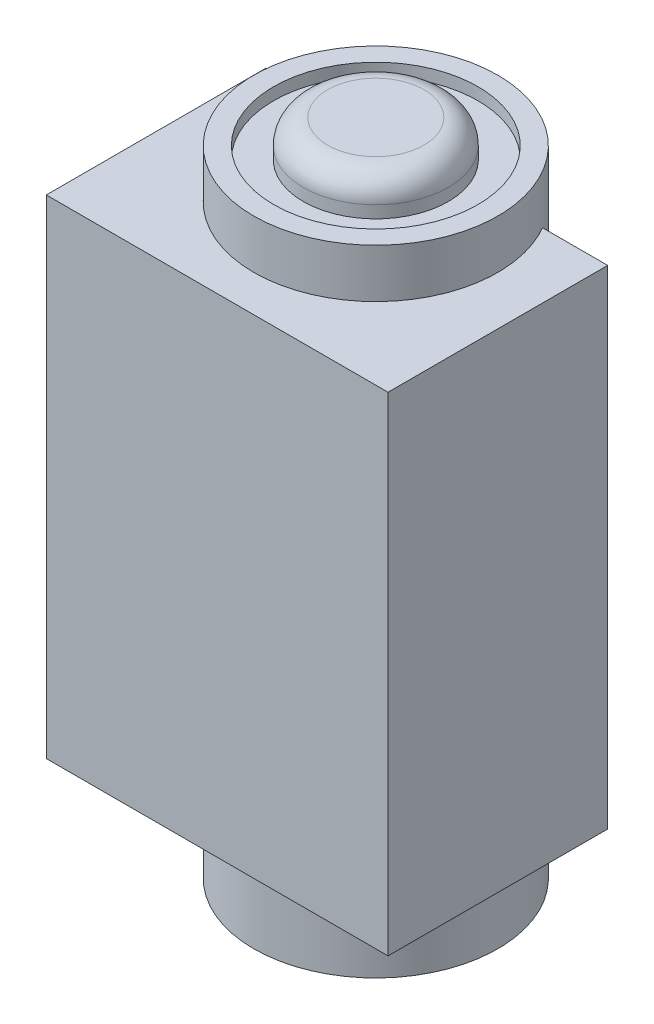
ISO-10303-21;
HEADER;
FILE_DESCRIPTION(('STEP AP214'),'2;1');
FILE_NAME('part.step','',(''),(''),'','','');
FILE_SCHEMA(('AUTOMOTIVE_DESIGN { 1 0 10303 214 1 1 1 1 }'));
ENDSEC;
DATA;
#1=APPLICATION_CONTEXT('core data for automotive mechanical design processes');
#2=APPLICATION_PROTOCOL_DEFINITION('international standard','automotive_design',2000,#1);
#3=PRODUCT_CONTEXT('',#1,'mechanical');
#4=PRODUCT('Part','Part','',(#3));
#5=PRODUCT_RELATED_PRODUCT_CATEGORY('part','',(#4));
#6=PRODUCT_DEFINITION_FORMATION('','',#4);
#7=PRODUCT_DEFINITION_CONTEXT('part definition',#1,'design');
#8=PRODUCT_DEFINITION('design','',#6,#7);
#9=PRODUCT_DEFINITION_SHAPE('','',#8);
#10=(LENGTH_UNIT() NAMED_UNIT(*) SI_UNIT(.MILLI.,.METRE.));
#11=(NAMED_UNIT(*) PLANE_ANGLE_UNIT() SI_UNIT($,.RADIAN.));
#12=(NAMED_UNIT(*) SI_UNIT($,.STERADIAN.) SOLID_ANGLE_UNIT());
#13=UNCERTAINTY_MEASURE_WITH_UNIT(LENGTH_MEASURE(1.E-05),#10,'distance_accuracy_value','');
#14=(GEOMETRIC_REPRESENTATION_CONTEXT(3) GLOBAL_UNCERTAINTY_ASSIGNED_CONTEXT((#13)) GLOBAL_UNIT_ASSIGNED_CONTEXT((#10,
#11,#12)) REPRESENTATION_CONTEXT('',''));
#15=CARTESIAN_POINT('',(0.,0.,0.));
#16=DIRECTION('',(0.,0.,1.));
#17=DIRECTION('',(1.,0.,0.));
#18=AXIS2_PLACEMENT_3D('',#15,#16,#17);
#19=CARTESIAN_POINT('',(0.,-4.,-2.));
#20=DIRECTION('',(0.,1.,0.));
#21=DIRECTION('',(0.,0.,1.));
#22=AXIS2_PLACEMENT_3D('',#19,#20,#21);
#23=CYLINDRICAL_SURFACE('',#22,4.19121199562566);
#24=CARTESIAN_POINT('',(0.,-4.,-2.));
#25=DIRECTION('',(0.,-1.,0.));
#26=DIRECTION('',(0.,0.,-1.));
#27=AXIS2_PLACEMENT_3D('',#24,#25,#26);
#28=CIRCLE('',#27,4.19121199562566);
#29=CARTESIAN_POINT('',(0.,-4.,-6.19121199562566));
#30=VERTEX_POINT('',#29);
#31=EDGE_CURVE('E11',#30,#30,#28,.T.);
#32=ORIENTED_EDGE('',*,*,#31,.F.);
#33=EDGE_LOOP('',(#32));
#34=FACE_BOUND('',#33,.T.);
#35=CARTESIAN_POINT('',(0.,-3.75,-2.));
#36=DIRECTION('',(0.,-1.,0.));
#37=DIRECTION('',(0.,0.,-1.));
#38=AXIS2_PLACEMENT_3D('',#35,#36,#37);
#39=CIRCLE('',#38,4.19121199562566);
#40=CARTESIAN_POINT('',(0.,-3.75,-6.19121199562566));
#41=VERTEX_POINT('',#40);
#42=EDGE_CURVE('E51',#41,#41,#39,.T.);
#43=ORIENTED_EDGE('',*,*,#42,.T.);
#44=EDGE_LOOP('',(#43));
#45=FACE_BOUND('',#44,.T.);
#46=ADVANCED_FACE('F48',(#34,#45),#23,.T.);
#47=CARTESIAN_POINT('',(0.,-4.,-2.));
#48=DIRECTION('',(0.,-1.,0.));
#49=DIRECTION('',(0.,0.,-1.));
#50=AXIS2_PLACEMENT_3D('',#47,#48,#49);
#51=PLANE('',#50);
#52=ORIENTED_EDGE('',*,*,#31,.T.);
#53=EDGE_LOOP('',(#52));
#54=FACE_BOUND('',#53,.T.);
#55=ADVANCED_FACE('F63',(#54),#51,.T.);
#56=CARTESIAN_POINT('',(0.,-3.75,-2.));
#57=DIRECTION('',(0.,-1.,0.));
#58=DIRECTION('',(0.,0.,-1.));
#59=AXIS2_PLACEMENT_3D('',#56,#57,#58);
#60=PLANE('',#59);
#61=ORIENTED_EDGE('',*,*,#42,.F.);
#62=EDGE_LOOP('',(#61));
#63=FACE_BOUND('',#62,.T.);
#64=ADVANCED_FACE('F61',(#63),#60,.F.);
#65=CLOSED_SHELL('',(#46,#55,#64));
#66=MANIFOLD_SOLID_BREP('B2',#65);
#67=CARTESIAN_POINT('',(0.,22.,-2.));
#68=DIRECTION('',(0.,-1.,0.));
#69=DIRECTION('',(0.,0.,-1.));
#70=AXIS2_PLACEMENT_3D('',#67,#68,#69);
#71=CYLINDRICAL_SURFACE('',#70,5.);
#72=CARTESIAN_POINT('',(0.,22.,-2.));
#73=DIRECTION('',(0.,1.,0.));
#74=DIRECTION('',(0.,0.,1.));
#75=AXIS2_PLACEMENT_3D('',#72,#73,#74);
#76=CIRCLE('',#75,5.);
#77=CARTESIAN_POINT('',(0.,22.,3.00000000000001));
#78=VERTEX_POINT('',#77);
#79=EDGE_CURVE('E111',#78,#78,#76,.T.);
#80=ORIENTED_EDGE('',*,*,#79,.F.);
#81=EDGE_LOOP('',(#80));
#82=FACE_BOUND('',#81,.T.);
#83=CARTESIAN_POINT('',(0.,-4.,-2.));
#84=DIRECTION('',(0.,1.,0.));
#85=DIRECTION('',(0.,0.,1.));
#86=AXIS2_PLACEMENT_3D('',#83,#84,#85);
#87=CIRCLE('',#86,5.);
#88=CARTESIAN_POINT('',(0.,-4.,3.00000000000001));
#89=VERTEX_POINT('',#88);
#90=EDGE_CURVE('E116',#89,#89,#87,.T.);
#91=ORIENTED_EDGE('',*,*,#90,.T.);
#92=EDGE_LOOP('',(#91));
#93=FACE_BOUND('',#92,.T.);
#94=ADVANCED_FACE('F98',(#82,#93),#71,.T.);
#95=CARTESIAN_POINT('',(0.,22.,-2.));
#96=DIRECTION('',(0.,1.,0.));
#97=DIRECTION('',(0.,0.,1.));
#98=AXIS2_PLACEMENT_3D('',#95,#96,#97);
#99=PLANE('',#98);
#100=CARTESIAN_POINT('',(0.,22.,-2.));
#101=DIRECTION('',(0.,1.,0.));
#102=DIRECTION('',(0.,0.,1.));
#103=AXIS2_PLACEMENT_3D('',#100,#101,#102);
#104=CIRCLE('',#103,4.18633493687747);
#105=CARTESIAN_POINT('',(0.,22.,2.18633493687747));
#106=VERTEX_POINT('',#105);
#107=EDGE_CURVE('E123',#106,#106,#104,.T.);
#108=ORIENTED_EDGE('',*,*,#107,.F.);
#109=EDGE_LOOP('',(#108));
#110=FACE_BOUND('',#109,.T.);
#111=ORIENTED_EDGE('',*,*,#79,.T.);
#112=EDGE_LOOP('',(#111));
#113=FACE_BOUND('',#112,.T.);
#114=ADVANCED_FACE('F155',(#110,#113),#99,.T.);
#115=CARTESIAN_POINT('',(0.,-4.,-2.));
#116=DIRECTION('',(0.,1.,0.));
#117=DIRECTION('',(0.,0.,1.));
#118=AXIS2_PLACEMENT_3D('',#115,#116,#117);
#119=PLANE('',#118);
#120=CARTESIAN_POINT('',(0.,-4.,-2.));
#121=DIRECTION('',(0.,-1.,0.));
#122=DIRECTION('',(0.,0.,-1.));
#123=AXIS2_PLACEMENT_3D('',#120,#121,#122);
#124=CIRCLE('',#123,4.40523673840694);
#125=CARTESIAN_POINT('',(0.,-4.,-6.40523673840694));
#126=VERTEX_POINT('',#125);
#127=EDGE_CURVE('E135',#126,#126,#124,.T.);
#128=ORIENTED_EDGE('',*,*,#127,.F.);
#129=EDGE_LOOP('',(#128));
#130=FACE_BOUND('',#129,.T.);
#131=ORIENTED_EDGE('',*,*,#90,.F.);
#132=EDGE_LOOP('',(#131));
#133=FACE_BOUND('',#132,.T.);
#134=ADVANCED_FACE('F151',(#130,#133),#119,.F.);
#135=CARTESIAN_POINT('',(0.,21.5,-2.));
#136=DIRECTION('',(0.,1.,0.));
#137=DIRECTION('',(0.,0.,1.));
#138=AXIS2_PLACEMENT_3D('',#135,#136,#137);
#139=CYLINDRICAL_SURFACE('',#138,4.18633493687747);
#140=CARTESIAN_POINT('',(0.,21.5,-2.));
#141=DIRECTION('',(0.,1.,0.));
#142=DIRECTION('',(0.,0.,1.));
#143=AXIS2_PLACEMENT_3D('',#140,#141,#142);
#144=CIRCLE('',#143,4.18633493687747);
#145=CARTESIAN_POINT('',(0.,21.5,2.18633493687747));
#146=VERTEX_POINT('',#145);
#147=EDGE_CURVE('E121',#146,#146,#144,.T.);
#148=ORIENTED_EDGE('',*,*,#147,.F.);
#149=EDGE_LOOP('',(#148));
#150=FACE_BOUND('',#149,.T.);
#151=ORIENTED_EDGE('',*,*,#107,.T.);
#152=EDGE_LOOP('',(#151));
#153=FACE_BOUND('',#152,.T.);
#154=ADVANCED_FACE('F154',(#150,#153),#139,.F.);
#155=CARTESIAN_POINT('',(0.,21.5,-2.));
#156=DIRECTION('',(0.,1.,0.));
#157=DIRECTION('',(0.,0.,1.));
#158=AXIS2_PLACEMENT_3D('',#155,#156,#157);
#159=PLANE('',#158);
#160=CARTESIAN_POINT('',(0.,21.5,-2.));
#161=DIRECTION('',(0.,1.,0.));
#162=DIRECTION('',(0.,0.,1.));
#163=AXIS2_PLACEMENT_3D('',#160,#161,#162);
#164=CIRCLE('',#163,2.97137082883303);
#165=CARTESIAN_POINT('',(0.,21.5,0.971370828833032));
#166=VERTEX_POINT('',#165);
#167=EDGE_CURVE('E127',#166,#166,#164,.T.);
#168=ORIENTED_EDGE('',*,*,#167,.F.);
#169=EDGE_LOOP('',(#168));
#170=FACE_BOUND('',#169,.T.);
#171=ORIENTED_EDGE('',*,*,#147,.T.);
#172=EDGE_LOOP('',(#171));
#173=FACE_BOUND('',#172,.T.);
#174=ADVANCED_FACE('F170',(#170,#173),#159,.T.);
#175=CARTESIAN_POINT('',(0.,23.,-2.));
#176=DIRECTION('',(0.,-1.,0.));
#177=DIRECTION('',(0.,0.,-1.));
#178=AXIS2_PLACEMENT_3D('',#175,#176,#177);
#179=CYLINDRICAL_SURFACE('',#178,2.97137082883303);
#180=CARTESIAN_POINT('',(0.,22.,-2.));
#181=DIRECTION('',(0.,1.,0.));
#182=DIRECTION('',(0.,0.,1.));
#183=AXIS2_PLACEMENT_3D('',#180,#181,#182);
#184=CIRCLE('',#183,2.97137082883303);
#185=CARTESIAN_POINT('',(0.,22.,0.971370828833032));
#186=VERTEX_POINT('',#185);
#187=EDGE_CURVE('E47',#186,#186,#184,.F.);
#188=ORIENTED_EDGE('',*,*,#187,.T.);
#189=EDGE_LOOP('',(#188));
#190=FACE_BOUND('',#189,.T.);
#191=ORIENTED_EDGE('',*,*,#167,.T.);
#192=EDGE_LOOP('',(#191));
#193=FACE_BOUND('',#192,.T.);
#194=ADVANCED_FACE('F174',(#190,#193),#179,.T.);
#195=CARTESIAN_POINT('',(0.,23.,-2.));
#196=DIRECTION('',(0.,1.,0.));
#197=DIRECTION('',(0.,0.,1.));
#198=AXIS2_PLACEMENT_3D('',#195,#196,#197);
#199=PLANE('',#198);
#200=CARTESIAN_POINT('',(0.,23.,-2.));
#201=DIRECTION('',(0.,1.,0.));
#202=DIRECTION('',(0.,0.,1.));
#203=AXIS2_PLACEMENT_3D('',#200,#201,#202);
#204=CIRCLE('',#203,1.97137082883303);
#205=CARTESIAN_POINT('',(0.,23.,-0.0286291711669683));
#206=VERTEX_POINT('',#205);
#207=EDGE_CURVE('E106',#206,#206,#204,.T.);
#208=ORIENTED_EDGE('',*,*,#207,.T.);
#209=EDGE_LOOP('',(#208));
#210=FACE_BOUND('',#209,.T.);
#211=ADVANCED_FACE('F178',(#210),#199,.T.);
#212=CARTESIAN_POINT('',(0.,22.,-2.));
#213=DIRECTION('',(0.,1.,0.));
#214=DIRECTION('',(0.,0.,1.));
#215=AXIS2_PLACEMENT_3D('',#212,#213,#214);
#216=TOROIDAL_SURFACE('',#215,1.97137082883303,1.);
#217=ORIENTED_EDGE('',*,*,#187,.F.);
#218=EDGE_LOOP('',(#217));
#219=FACE_BOUND('',#218,.T.);
#220=ORIENTED_EDGE('',*,*,#207,.F.);
#221=EDGE_LOOP('',(#220));
#222=FACE_BOUND('',#221,.T.);
#223=ADVANCED_FACE('F100',(#219,#222),#216,.T.);
#224=CARTESIAN_POINT('',(0.,-3.75,-2.));
#225=DIRECTION('',(0.,-1.,0.));
#226=DIRECTION('',(0.,0.,-1.));
#227=AXIS2_PLACEMENT_3D('',#224,#225,#226);
#228=CYLINDRICAL_SURFACE('',#227,4.40523673840694);
#229=CARTESIAN_POINT('',(0.,-3.75,-2.));
#230=DIRECTION('',(0.,-1.,0.));
#231=DIRECTION('',(0.,0.,-1.));
#232=AXIS2_PLACEMENT_3D('',#229,#230,#231);
#233=CIRCLE('',#232,4.40523673840694);
#234=CARTESIAN_POINT('',(0.,-3.75,-6.40523673840694));
#235=VERTEX_POINT('',#234);
#236=EDGE_CURVE('E134',#235,#235,#233,.T.);
#237=ORIENTED_EDGE('',*,*,#236,.F.);
#238=EDGE_LOOP('',(#237));
#239=FACE_BOUND('',#238,.T.);
#240=ORIENTED_EDGE('',*,*,#127,.T.);
#241=EDGE_LOOP('',(#240));
#242=FACE_BOUND('',#241,.T.);
#243=ADVANCED_FACE('F145',(#239,#242),#228,.F.);
#244=CARTESIAN_POINT('',(0.,-3.75,-2.));
#245=DIRECTION('',(0.,-1.,0.));
#246=DIRECTION('',(0.,0.,-1.));
#247=AXIS2_PLACEMENT_3D('',#244,#245,#246);
#248=PLANE('',#247);
#249=ORIENTED_EDGE('',*,*,#236,.T.);
#250=EDGE_LOOP('',(#249));
#251=FACE_BOUND('',#250,.T.);
#252=ADVANCED_FACE('F143',(#251),#248,.T.);
#253=CLOSED_SHELL('',(#94,#114,#134,#154,#174,#194,#211,#223,#243,#252));
#254=MANIFOLD_SOLID_BREP('B6',#253);
#255=CARTESIAN_POINT('',(-7.,20.,4.5));
#256=DIRECTION('',(1.,0.,0.));
#257=DIRECTION('',(0.,0.,-1.));
#258=AXIS2_PLACEMENT_3D('',#255,#256,#257);
#259=PLANE('',#258);
#260=DIRECTION('',(0.,0.,1.));
#261=VECTOR('',#260,1.);
#262=CARTESIAN_POINT('',(-7.,0.,4.5));
#263=LINE('',#262,#261);
#264=CARTESIAN_POINT('',(-7.,0.,-4.5));
#265=VERTEX_POINT('',#264);
#266=CARTESIAN_POINT('',(-7.,0.,4.5));
#267=VERTEX_POINT('',#266);
#268=EDGE_CURVE('E353',#265,#267,#263,.T.);
#269=ORIENTED_EDGE('',*,*,#268,.T.);
#270=DIRECTION('',(0.,-1.,0.));
#271=VECTOR('',#270,1.);
#272=CARTESIAN_POINT('',(-7.,20.,4.5));
#273=LINE('',#272,#271);
#274=CARTESIAN_POINT('',(-7.,20.,4.5));
#275=VERTEX_POINT('',#274);
#276=EDGE_CURVE('E96',#275,#267,#273,.T.);
#277=ORIENTED_EDGE('',*,*,#276,.F.);
#278=DIRECTION('',(0.,0.,1.));
#279=VECTOR('',#278,1.);
#280=CARTESIAN_POINT('',(-7.,20.,4.5));
#281=LINE('',#280,#279);
#282=CARTESIAN_POINT('',(-7.,20.,-4.5));
#283=VERTEX_POINT('',#282);
#284=EDGE_CURVE('E363',#283,#275,#281,.T.);
#285=ORIENTED_EDGE('',*,*,#284,.F.);
#286=DIRECTION('',(0.,-1.,0.));
#287=VECTOR('',#286,1.);
#288=CARTESIAN_POINT('',(-7.,20.,-4.5));
#289=LINE('',#288,#287);
#290=EDGE_CURVE('E349',#283,#265,#289,.T.);
#291=ORIENTED_EDGE('',*,*,#290,.T.);
#292=EDGE_LOOP('',(#269,#277,#285,#291));
#293=FACE_BOUND('',#292,.T.);
#294=ADVANCED_FACE('F269',(#293),#259,.F.);
#295=CARTESIAN_POINT('',(7.,20.,4.5));
#296=DIRECTION('',(0.,0.,-1.));
#297=DIRECTION('',(-1.,0.,0.));
#298=AXIS2_PLACEMENT_3D('',#295,#296,#297);
#299=PLANE('',#298);
#300=DIRECTION('',(1.,0.,0.));
#301=VECTOR('',#300,1.);
#302=CARTESIAN_POINT('',(7.,0.,4.5));
#303=LINE('',#302,#301);
#304=CARTESIAN_POINT('',(7.,0.,4.5));
#305=VERTEX_POINT('',#304);
#306=EDGE_CURVE('E356',#267,#305,#303,.T.);
#307=ORIENTED_EDGE('',*,*,#306,.T.);
#308=DIRECTION('',(0.,-1.,0.));
#309=VECTOR('',#308,1.);
#310=CARTESIAN_POINT('',(7.,20.,4.5));
#311=LINE('',#310,#309);
#312=CARTESIAN_POINT('',(7.,20.,4.5));
#313=VERTEX_POINT('',#312);
#314=EDGE_CURVE('E277',#313,#305,#311,.T.);
#315=ORIENTED_EDGE('',*,*,#314,.F.);
#316=DIRECTION('',(1.,0.,0.));
#317=VECTOR('',#316,1.);
#318=CARTESIAN_POINT('',(7.,20.,4.5));
#319=LINE('',#318,#317);
#320=EDGE_CURVE('E322',#275,#313,#319,.T.);
#321=ORIENTED_EDGE('',*,*,#320,.F.);
#322=ORIENTED_EDGE('',*,*,#276,.T.);
#323=EDGE_LOOP('',(#307,#315,#321,#322));
#324=FACE_BOUND('',#323,.T.);
#325=ADVANCED_FACE('F387',(#324),#299,.F.);
#326=CARTESIAN_POINT('',(7.,20.,4.5));
#327=DIRECTION('',(-1.,0.,0.));
#328=DIRECTION('',(0.,0.,1.));
#329=AXIS2_PLACEMENT_3D('',#326,#327,#328);
#330=PLANE('',#329);
#331=DIRECTION('',(0.,0.,-1.));
#332=VECTOR('',#331,1.);
#333=CARTESIAN_POINT('',(7.,0.,4.5));
#334=LINE('',#333,#332);
#335=CARTESIAN_POINT('',(7.,0.,-4.5));
#336=VERTEX_POINT('',#335);
#337=EDGE_CURVE('E358',#305,#336,#334,.T.);
#338=ORIENTED_EDGE('',*,*,#337,.T.);
#339=DIRECTION('',(0.,-1.,0.));
#340=VECTOR('',#339,1.);
#341=CARTESIAN_POINT('',(7.,20.,-4.5));
#342=LINE('',#341,#340);
#343=CARTESIAN_POINT('',(7.,20.,-4.5));
#344=VERTEX_POINT('',#343);
#345=EDGE_CURVE('E344',#344,#336,#342,.T.);
#346=ORIENTED_EDGE('',*,*,#345,.F.);
#347=DIRECTION('',(0.,0.,-1.));
#348=VECTOR('',#347,1.);
#349=CARTESIAN_POINT('',(7.,20.,4.5));
#350=LINE('',#349,#348);
#351=EDGE_CURVE('E335',#313,#344,#350,.T.);
#352=ORIENTED_EDGE('',*,*,#351,.F.);
#353=ORIENTED_EDGE('',*,*,#314,.T.);
#354=EDGE_LOOP('',(#338,#346,#352,#353));
#355=FACE_BOUND('',#354,.T.);
#356=ADVANCED_FACE('F369',(#355),#330,.F.);
#357=CARTESIAN_POINT('',(7.,20.,-4.5));
#358=DIRECTION('',(0.,0.,1.));
#359=DIRECTION('',(1.,0.,0.));
#360=AXIS2_PLACEMENT_3D('',#357,#358,#359);
#361=PLANE('',#360);
#362=DIRECTION('',(-1.,0.,0.));
#363=VECTOR('',#362,1.);
#364=CARTESIAN_POINT('',(7.,0.,-4.5));
#365=LINE('',#364,#363);
#366=CARTESIAN_POINT('',(4.3301270189222,0.,-4.5));
#367=VERTEX_POINT('',#366);
#368=EDGE_CURVE('E343',#336,#367,#365,.T.);
#369=ORIENTED_EDGE('',*,*,#368,.T.);
#370=DIRECTION('',(0.,-1.,0.));
#371=VECTOR('',#370,1.);
#372=CARTESIAN_POINT('',(4.3301270189222,20.,-4.5));
#373=LINE('',#372,#371);
#374=CARTESIAN_POINT('',(4.3301270189222,20.,-4.5));
#375=VERTEX_POINT('',#374);
#376=EDGE_CURVE('E340',#375,#367,#373,.T.);
#377=ORIENTED_EDGE('',*,*,#376,.F.);
#378=DIRECTION('',(-1.,0.,0.));
#379=VECTOR('',#378,1.);
#380=CARTESIAN_POINT('',(7.,20.,-4.5));
#381=LINE('',#380,#379);
#382=EDGE_CURVE('E329',#344,#375,#381,.T.);
#383=ORIENTED_EDGE('',*,*,#382,.F.);
#384=ORIENTED_EDGE('',*,*,#345,.T.);
#385=EDGE_LOOP('',(#369,#377,#383,#384));
#386=FACE_BOUND('',#385,.T.);
#387=ADVANCED_FACE('F341',(#386),#361,.F.);
#388=CARTESIAN_POINT('',(0.,20.,-2.));
#389=DIRECTION('',(0.,-1.,0.));
#390=DIRECTION('',(0.,0.,-1.));
#391=AXIS2_PLACEMENT_3D('',#388,#389,#390);
#392=CYLINDRICAL_SURFACE('',#391,5.);
#393=CARTESIAN_POINT('',(0.,0.,-2.));
#394=DIRECTION('',(0.,-1.,0.));
#395=DIRECTION('',(0.,0.,1.));
#396=AXIS2_PLACEMENT_3D('',#393,#394,#395);
#397=CIRCLE('',#396,5.);
#398=CARTESIAN_POINT('',(-4.3301270189222,0.,-4.5));
#399=VERTEX_POINT('',#398);
#400=EDGE_CURVE('E308',#367,#399,#397,.T.);
#401=ORIENTED_EDGE('',*,*,#400,.T.);
#402=DIRECTION('',(0.,-1.,0.));
#403=VECTOR('',#402,1.);
#404=CARTESIAN_POINT('',(-4.3301270189222,20.,-4.5));
#405=LINE('',#404,#403);
#406=CARTESIAN_POINT('',(-4.3301270189222,20.,-4.5));
#407=VERTEX_POINT('',#406);
#408=EDGE_CURVE('E345',#407,#399,#405,.T.);
#409=ORIENTED_EDGE('',*,*,#408,.F.);
#410=CARTESIAN_POINT('',(0.,20.,-2.));
#411=DIRECTION('',(0.,-1.,0.));
#412=DIRECTION('',(0.,0.,1.));
#413=AXIS2_PLACEMENT_3D('',#410,#411,#412);
#414=CIRCLE('',#413,5.);
#415=EDGE_CURVE('E333',#375,#407,#414,.T.);
#416=ORIENTED_EDGE('',*,*,#415,.F.);
#417=ORIENTED_EDGE('',*,*,#376,.T.);
#418=EDGE_LOOP('',(#401,#409,#416,#417));
#419=FACE_BOUND('',#418,.T.);
#420=ADVANCED_FACE('F347',(#419),#392,.F.);
#421=CARTESIAN_POINT('',(-4.3301270189222,20.,-4.5));
#422=DIRECTION('',(0.,0.,1.));
#423=DIRECTION('',(1.,0.,0.));
#424=AXIS2_PLACEMENT_3D('',#421,#422,#423);
#425=PLANE('',#424);
#426=DIRECTION('',(-1.,0.,0.));
#427=VECTOR('',#426,1.);
#428=CARTESIAN_POINT('',(-4.3301270189222,0.,-4.5));
#429=LINE('',#428,#427);
#430=EDGE_CURVE('E314',#399,#265,#429,.T.);
#431=ORIENTED_EDGE('',*,*,#430,.T.);
#432=ORIENTED_EDGE('',*,*,#290,.F.);
#433=DIRECTION('',(-1.,0.,0.));
#434=VECTOR('',#433,1.);
#435=CARTESIAN_POINT('',(-4.3301270189222,20.,-4.5));
#436=LINE('',#435,#434);
#437=EDGE_CURVE('E285',#407,#283,#436,.T.);
#438=ORIENTED_EDGE('',*,*,#437,.F.);
#439=ORIENTED_EDGE('',*,*,#408,.T.);
#440=EDGE_LOOP('',(#431,#432,#438,#439));
#441=FACE_BOUND('',#440,.T.);
#442=ADVANCED_FACE('F376',(#441),#425,.F.);
#443=CARTESIAN_POINT('',(0.,20.,-2.));
#444=DIRECTION('',(0.,1.,0.));
#445=DIRECTION('',(0.,0.,1.));
#446=AXIS2_PLACEMENT_3D('',#443,#444,#445);
#447=PLANE('',#446);
#448=ORIENTED_EDGE('',*,*,#284,.T.);
#449=ORIENTED_EDGE('',*,*,#320,.T.);
#450=ORIENTED_EDGE('',*,*,#351,.T.);
#451=ORIENTED_EDGE('',*,*,#382,.T.);
#452=ORIENTED_EDGE('',*,*,#415,.T.);
#453=ORIENTED_EDGE('',*,*,#437,.T.);
#454=EDGE_LOOP('',(#448,#449,#450,#451,#452,#453));
#455=FACE_BOUND('',#454,.T.);
#456=ADVANCED_FACE('F331',(#455),#447,.T.);
#457=CARTESIAN_POINT('',(0.,0.,-2.));
#458=DIRECTION('',(0.,1.,0.));
#459=DIRECTION('',(0.,0.,1.));
#460=AXIS2_PLACEMENT_3D('',#457,#458,#459);
#461=PLANE('',#460);
#462=ORIENTED_EDGE('',*,*,#268,.F.);
#463=ORIENTED_EDGE('',*,*,#430,.F.);
#464=ORIENTED_EDGE('',*,*,#400,.F.);
#465=ORIENTED_EDGE('',*,*,#368,.F.);
#466=ORIENTED_EDGE('',*,*,#337,.F.);
#467=ORIENTED_EDGE('',*,*,#306,.F.);
#468=EDGE_LOOP('',(#462,#463,#464,#465,#466,#467));
#469=FACE_BOUND('',#468,.T.);
#470=ADVANCED_FACE('F372',(#469),#461,.F.);
#471=CLOSED_SHELL('',(#294,#325,#356,#387,#420,#442,#456,#470));
#472=MANIFOLD_SOLID_BREP('B42',#471);
#473=ADVANCED_BREP_SHAPE_REPRESENTATION('',(#18,#66,#254,#472),#14);
#474=SHAPE_DEFINITION_REPRESENTATION(#9,#473);
ENDSEC;
END-ISO-10303-21;
